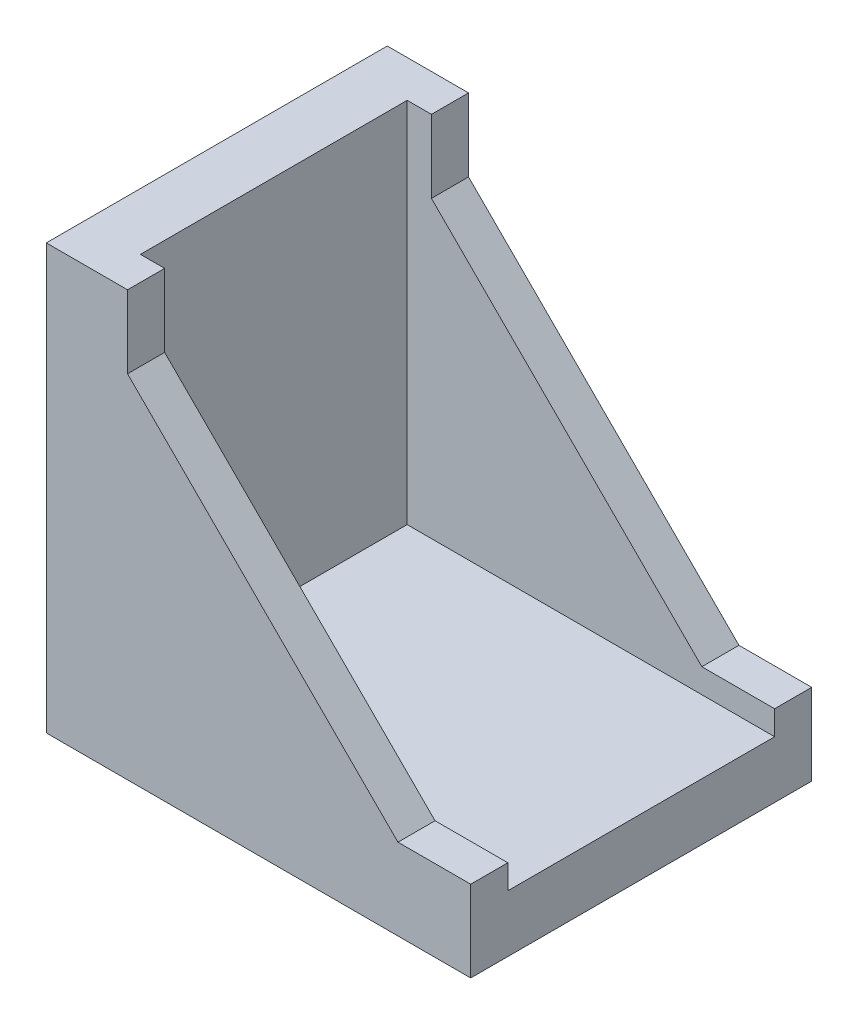
ISO-10303-21;
HEADER;
FILE_DESCRIPTION(('STEP AP214'),'2;1');
FILE_NAME('part.step','',(''),(''),'','','');
FILE_SCHEMA(('AUTOMOTIVE_DESIGN { 1 0 10303 214 1 1 1 1 }'));
ENDSEC;
DATA;
#1=APPLICATION_CONTEXT('core data for automotive mechanical design processes');
#2=APPLICATION_PROTOCOL_DEFINITION('international standard','automotive_design',2000,#1);
#3=PRODUCT_CONTEXT('',#1,'mechanical');
#4=PRODUCT('Part','Part','',(#3));
#5=PRODUCT_RELATED_PRODUCT_CATEGORY('part','',(#4));
#6=PRODUCT_DEFINITION_FORMATION('','',#4);
#7=PRODUCT_DEFINITION_CONTEXT('part definition',#1,'design');
#8=PRODUCT_DEFINITION('design','',#6,#7);
#9=PRODUCT_DEFINITION_SHAPE('','',#8);
#10=(LENGTH_UNIT() NAMED_UNIT(*) SI_UNIT(.MILLI.,.METRE.));
#11=(NAMED_UNIT(*) PLANE_ANGLE_UNIT() SI_UNIT($,.RADIAN.));
#12=(NAMED_UNIT(*) SI_UNIT($,.STERADIAN.) SOLID_ANGLE_UNIT());
#13=UNCERTAINTY_MEASURE_WITH_UNIT(LENGTH_MEASURE(1.E-05),#10,'distance_accuracy_value','');
#14=(GEOMETRIC_REPRESENTATION_CONTEXT(3) GLOBAL_UNCERTAINTY_ASSIGNED_CONTEXT((#13)) GLOBAL_UNIT_ASSIGNED_CONTEXT((#10,
#11,#12)) REPRESENTATION_CONTEXT('',''));
#15=CARTESIAN_POINT('',(0.,0.,0.));
#16=DIRECTION('',(0.,0.,1.));
#17=DIRECTION('',(1.,0.,0.));
#18=AXIS2_PLACEMENT_3D('',#15,#16,#17);
#19=CARTESIAN_POINT('',(29.,6.7,14.06));
#20=DIRECTION('',(0.,-1.,0.));
#21=DIRECTION('',(0.,0.,-1.));
#22=AXIS2_PLACEMENT_3D('',#19,#20,#21);
#23=PLANE('',#22);
#24=DIRECTION('',(1.,0.,0.));
#25=VECTOR('',#24,1.);
#26=CARTESIAN_POINT('',(29.,6.7,11.));
#27=LINE('',#26,#25);
#28=CARTESIAN_POINT('',(29.,6.7,11.));
#29=VERTEX_POINT('',#28);
#30=CARTESIAN_POINT('',(34.9999999999983,6.7,11.));
#31=VERTEX_POINT('',#30);
#32=EDGE_CURVE('E204',#29,#31,#27,.T.);
#33=ORIENTED_EDGE('',*,*,#32,.F.);
#34=DIRECTION('',(0.,0.,-1.));
#35=VECTOR('',#34,1.);
#36=CARTESIAN_POINT('',(29.,6.7,14.06));
#37=LINE('',#36,#35);
#38=CARTESIAN_POINT('',(29.,6.7,14.06));
#39=VERTEX_POINT('',#38);
#40=EDGE_CURVE('E165',#39,#29,#37,.T.);
#41=ORIENTED_EDGE('',*,*,#40,.F.);
#42=DIRECTION('',(-1.,0.,0.));
#43=VECTOR('',#42,1.);
#44=CARTESIAN_POINT('',(29.,6.7,14.06));
#45=LINE('',#44,#43);
#46=CARTESIAN_POINT('',(35.,6.7,14.06));
#47=VERTEX_POINT('',#46);
#48=EDGE_CURVE('E216',#47,#39,#45,.T.);
#49=ORIENTED_EDGE('',*,*,#48,.F.);
#50=DIRECTION('',(0.,0.,-1.));
#51=VECTOR('',#50,1.);
#52=CARTESIAN_POINT('',(35.,6.7,14.06));
#53=LINE('',#52,#51);
#54=EDGE_CURVE('E169',#47,#31,#53,.T.);
#55=ORIENTED_EDGE('',*,*,#54,.T.);
#56=EDGE_LOOP('',(#33,#41,#49,#55));
#57=FACE_BOUND('',#56,.T.);
#58=ADVANCED_FACE('F33',(#57),#23,.F.);
#59=CARTESIAN_POINT('',(6.7,29.,14.06));
#60=DIRECTION('',(-0.707106781186548,-0.707106781186548,0.));
#61=DIRECTION('',(0.707106781186548,-0.707106781186548,0.));
#62=AXIS2_PLACEMENT_3D('',#59,#60,#61);
#63=PLANE('',#62);
#64=DIRECTION('',(0.707106781186548,-0.707106781186548,0.));
#65=VECTOR('',#64,1.);
#66=CARTESIAN_POINT('',(6.7,29.,11.));
#67=LINE('',#66,#65);
#68=CARTESIAN_POINT('',(6.7,29.,11.));
#69=VERTEX_POINT('',#68);
#70=EDGE_CURVE('E191',#69,#29,#67,.T.);
#71=ORIENTED_EDGE('',*,*,#70,.F.);
#72=DIRECTION('',(0.,0.,-1.));
#73=VECTOR('',#72,1.);
#74=CARTESIAN_POINT('',(6.7,29.,14.06));
#75=LINE('',#74,#73);
#76=CARTESIAN_POINT('',(6.7,29.,14.06));
#77=VERTEX_POINT('',#76);
#78=EDGE_CURVE('E162',#77,#69,#75,.T.);
#79=ORIENTED_EDGE('',*,*,#78,.F.);
#80=DIRECTION('',(-0.707106781186547,0.707106781186547,0.));
#81=VECTOR('',#80,1.);
#82=CARTESIAN_POINT('',(6.7,29.,14.06));
#83=LINE('',#82,#81);
#84=EDGE_CURVE('E115',#39,#77,#83,.T.);
#85=ORIENTED_EDGE('',*,*,#84,.F.);
#86=ORIENTED_EDGE('',*,*,#40,.T.);
#87=EDGE_LOOP('',(#71,#79,#85,#86));
#88=FACE_BOUND('',#87,.T.);
#89=ADVANCED_FACE('F223',(#88),#63,.F.);
#90=CARTESIAN_POINT('',(6.7,35.,14.06));
#91=DIRECTION('',(-1.,0.,0.));
#92=DIRECTION('',(0.,0.,1.));
#93=AXIS2_PLACEMENT_3D('',#90,#91,#92);
#94=PLANE('',#93);
#95=DIRECTION('',(0.,-1.,0.));
#96=VECTOR('',#95,1.);
#97=CARTESIAN_POINT('',(6.7,35.,11.));
#98=LINE('',#97,#96);
#99=CARTESIAN_POINT('',(6.7,34.9999999999983,11.));
#100=VERTEX_POINT('',#99);
#101=EDGE_CURVE('E126',#100,#69,#98,.T.);
#102=ORIENTED_EDGE('',*,*,#101,.F.);
#103=DIRECTION('',(0.,0.,-1.));
#104=VECTOR('',#103,1.);
#105=CARTESIAN_POINT('',(6.7,35.,14.06));
#106=LINE('',#105,#104);
#107=CARTESIAN_POINT('',(6.7,35.,14.06));
#108=VERTEX_POINT('',#107);
#109=EDGE_CURVE('E122',#108,#100,#106,.T.);
#110=ORIENTED_EDGE('',*,*,#109,.F.);
#111=DIRECTION('',(0.,1.,0.));
#112=VECTOR('',#111,1.);
#113=CARTESIAN_POINT('',(6.7,35.,14.06));
#114=LINE('',#113,#112);
#115=EDGE_CURVE('E108',#77,#108,#114,.T.);
#116=ORIENTED_EDGE('',*,*,#115,.F.);
#117=ORIENTED_EDGE('',*,*,#78,.T.);
#118=EDGE_LOOP('',(#102,#110,#116,#117));
#119=FACE_BOUND('',#118,.T.);
#120=ADVANCED_FACE('F123',(#119),#94,.F.);
#121=CARTESIAN_POINT('',(35.,0.,14.06));
#122=DIRECTION('',(0.,1.,0.));
#123=DIRECTION('',(0.,0.,1.));
#124=AXIS2_PLACEMENT_3D('',#121,#122,#123);
#125=PLANE('',#124);
#126=DIRECTION('',(1.,0.,0.));
#127=VECTOR('',#126,1.);
#128=CARTESIAN_POINT('',(35.,0.,-14.06));
#129=LINE('',#128,#127);
#130=CARTESIAN_POINT('',(0.,0.,-14.06));
#131=VERTEX_POINT('',#130);
#132=CARTESIAN_POINT('',(35.,0.,-14.06));
#133=VERTEX_POINT('',#132);
#134=EDGE_CURVE('E140',#131,#133,#129,.T.);
#135=ORIENTED_EDGE('',*,*,#134,.T.);
#136=DIRECTION('',(0.,0.,-1.));
#137=VECTOR('',#136,1.);
#138=CARTESIAN_POINT('',(35.,0.,14.06));
#139=LINE('',#138,#137);
#140=CARTESIAN_POINT('',(35.,0.,14.06));
#141=VERTEX_POINT('',#140);
#142=EDGE_CURVE('E172',#141,#133,#139,.T.);
#143=ORIENTED_EDGE('',*,*,#142,.F.);
#144=DIRECTION('',(1.,0.,0.));
#145=VECTOR('',#144,1.);
#146=CARTESIAN_POINT('',(35.,0.,14.06));
#147=LINE('',#146,#145);
#148=CARTESIAN_POINT('',(0.,0.,14.06));
#149=VERTEX_POINT('',#148);
#150=EDGE_CURVE('E159',#149,#141,#147,.T.);
#151=ORIENTED_EDGE('',*,*,#150,.F.);
#152=DIRECTION('',(0.,0.,-1.));
#153=VECTOR('',#152,1.);
#154=CARTESIAN_POINT('',(0.,0.,14.06));
#155=LINE('',#154,#153);
#156=EDGE_CURVE('E136',#149,#131,#155,.T.);
#157=ORIENTED_EDGE('',*,*,#156,.T.);
#158=EDGE_LOOP('',(#135,#143,#151,#157));
#159=FACE_BOUND('',#158,.T.);
#160=ADVANCED_FACE('F35',(#159),#125,.F.);
#161=CARTESIAN_POINT('',(35.,6.7,14.06));
#162=DIRECTION('',(-1.,0.,0.));
#163=DIRECTION('',(0.,0.,1.));
#164=AXIS2_PLACEMENT_3D('',#161,#162,#163);
#165=PLANE('',#164);
#166=CARTESIAN_POINT('',(34.9999999999983,6.7,-11.));
#167=VERTEX_POINT('',#166);
#168=CARTESIAN_POINT('',(35.,6.7,-14.06));
#169=VERTEX_POINT('',#168);
#170=EDGE_CURVE('E168',#167,#169,#53,.T.);
#171=ORIENTED_EDGE('',*,*,#170,.F.);
#172=DIRECTION('',(0.,1.,0.));
#173=VECTOR('',#172,1.);
#174=CARTESIAN_POINT('',(34.9999999999983,4.69999999999274,-11.));
#175=LINE('',#174,#173);
#176=CARTESIAN_POINT('',(34.9999999999983,4.69999999999274,-11.));
#177=VERTEX_POINT('',#176);
#178=EDGE_CURVE('E201',#177,#167,#175,.T.);
#179=ORIENTED_EDGE('',*,*,#178,.F.);
#180=DIRECTION('',(0.,0.,1.));
#181=VECTOR('',#180,1.);
#182=CARTESIAN_POINT('',(34.9999999999983,4.69999999999274,-11.));
#183=LINE('',#182,#181);
#184=CARTESIAN_POINT('',(34.9999999999983,4.69999999999274,11.));
#185=VERTEX_POINT('',#184);
#186=EDGE_CURVE('E189',#177,#185,#183,.T.);
#187=ORIENTED_EDGE('',*,*,#186,.T.);
#188=DIRECTION('',(0.,1.,0.));
#189=VECTOR('',#188,1.);
#190=CARTESIAN_POINT('',(34.9999999999983,4.69999999999274,11.));
#191=LINE('',#190,#189);
#192=EDGE_CURVE('E197',#185,#31,#191,.T.);
#193=ORIENTED_EDGE('',*,*,#192,.T.);
#194=ORIENTED_EDGE('',*,*,#54,.F.);
#195=DIRECTION('',(0.,1.,0.));
#196=VECTOR('',#195,1.);
#197=CARTESIAN_POINT('',(35.,6.7,14.06));
#198=LINE('',#197,#196);
#199=EDGE_CURVE('E96',#141,#47,#198,.T.);
#200=ORIENTED_EDGE('',*,*,#199,.F.);
#201=ORIENTED_EDGE('',*,*,#142,.T.);
#202=DIRECTION('',(0.,1.,0.));
#203=VECTOR('',#202,1.);
#204=CARTESIAN_POINT('',(35.,6.7,-14.06));
#205=LINE('',#204,#203);
#206=EDGE_CURVE('E143',#133,#169,#205,.T.);
#207=ORIENTED_EDGE('',*,*,#206,.T.);
#208=EDGE_LOOP('',(#171,#179,#187,#193,#194,#200,#201,#207));
#209=FACE_BOUND('',#208,.T.);
#210=ADVANCED_FACE('F276',(#209),#165,.F.);
#211=CARTESIAN_POINT('',(29.,6.7,-11.));
#212=VERTEX_POINT('',#211);
#213=CARTESIAN_POINT('',(29.,6.7,-14.06));
#214=VERTEX_POINT('',#213);
#215=EDGE_CURVE('E164',#212,#214,#37,.T.);
#216=ORIENTED_EDGE('',*,*,#215,.F.);
#217=DIRECTION('',(1.,0.,0.));
#218=VECTOR('',#217,1.);
#219=CARTESIAN_POINT('',(29.,6.7,-11.));
#220=LINE('',#219,#218);
#221=EDGE_CURVE('E144',#212,#167,#220,.T.);
#222=ORIENTED_EDGE('',*,*,#221,.T.);
#223=ORIENTED_EDGE('',*,*,#170,.T.);
#224=DIRECTION('',(-1.,0.,0.));
#225=VECTOR('',#224,1.);
#226=CARTESIAN_POINT('',(29.,6.7,-14.06));
#227=LINE('',#226,#225);
#228=EDGE_CURVE('E147',#169,#214,#227,.T.);
#229=ORIENTED_EDGE('',*,*,#228,.T.);
#230=EDGE_LOOP('',(#216,#222,#223,#229));
#231=FACE_BOUND('',#230,.T.);
#232=ADVANCED_FACE('F245',(#231),#23,.F.);
#233=CARTESIAN_POINT('',(6.7,29.,-11.));
#234=VERTEX_POINT('',#233);
#235=CARTESIAN_POINT('',(6.7,29.,-14.06));
#236=VERTEX_POINT('',#235);
#237=EDGE_CURVE('E129',#234,#236,#75,.T.);
#238=ORIENTED_EDGE('',*,*,#237,.F.);
#239=DIRECTION('',(0.707106781186548,-0.707106781186548,0.));
#240=VECTOR('',#239,1.);
#241=CARTESIAN_POINT('',(6.7,29.,-11.));
#242=LINE('',#241,#240);
#243=EDGE_CURVE('E209',#234,#212,#242,.T.);
#244=ORIENTED_EDGE('',*,*,#243,.T.);
#245=ORIENTED_EDGE('',*,*,#215,.T.);
#246=DIRECTION('',(-0.707106781186547,0.707106781186547,0.));
#247=VECTOR('',#246,1.);
#248=CARTESIAN_POINT('',(6.7,29.,-14.06));
#249=LINE('',#248,#247);
#250=EDGE_CURVE('E150',#214,#236,#249,.T.);
#251=ORIENTED_EDGE('',*,*,#250,.T.);
#252=EDGE_LOOP('',(#238,#244,#245,#251));
#253=FACE_BOUND('',#252,.T.);
#254=ADVANCED_FACE('F244',(#253),#63,.F.);
#255=CARTESIAN_POINT('',(6.7,34.9999999999983,-11.));
#256=VERTEX_POINT('',#255);
#257=CARTESIAN_POINT('',(6.7,35.,-14.06));
#258=VERTEX_POINT('',#257);
#259=EDGE_CURVE('E130',#256,#258,#106,.T.);
#260=ORIENTED_EDGE('',*,*,#259,.F.);
#261=DIRECTION('',(0.,-1.,0.));
#262=VECTOR('',#261,1.);
#263=CARTESIAN_POINT('',(6.7,35.,-11.));
#264=LINE('',#263,#262);
#265=EDGE_CURVE('E206',#256,#234,#264,.T.);
#266=ORIENTED_EDGE('',*,*,#265,.T.);
#267=ORIENTED_EDGE('',*,*,#237,.T.);
#268=DIRECTION('',(0.,1.,0.));
#269=VECTOR('',#268,1.);
#270=CARTESIAN_POINT('',(6.7,35.,-14.06));
#271=LINE('',#270,#269);
#272=EDGE_CURVE('E153',#236,#258,#271,.T.);
#273=ORIENTED_EDGE('',*,*,#272,.T.);
#274=EDGE_LOOP('',(#260,#266,#267,#273));
#275=FACE_BOUND('',#274,.T.);
#276=ADVANCED_FACE('F254',(#275),#94,.F.);
#277=CARTESIAN_POINT('',(0.,35.,14.06));
#278=DIRECTION('',(0.,-1.,0.));
#279=DIRECTION('',(0.,0.,-1.));
#280=AXIS2_PLACEMENT_3D('',#277,#278,#279);
#281=PLANE('',#280);
#282=DIRECTION('',(0.,0.,1.));
#283=VECTOR('',#282,1.);
#284=CARTESIAN_POINT('',(4.70000000000696,34.9999999999983,-11.));
#285=LINE('',#284,#283);
#286=CARTESIAN_POINT('',(4.70000000000696,34.9999999999983,-11.));
#287=VERTEX_POINT('',#286);
#288=CARTESIAN_POINT('',(4.70000000000696,35.,11.));
#289=VERTEX_POINT('',#288);
#290=EDGE_CURVE('E181',#287,#289,#285,.T.);
#291=ORIENTED_EDGE('',*,*,#290,.F.);
#292=DIRECTION('',(1.,0.,0.));
#293=VECTOR('',#292,1.);
#294=CARTESIAN_POINT('',(0.,35.,-11.));
#295=LINE('',#294,#293);
#296=EDGE_CURVE('E11',#287,#256,#295,.T.);
#297=ORIENTED_EDGE('',*,*,#296,.T.);
#298=ORIENTED_EDGE('',*,*,#259,.T.);
#299=DIRECTION('',(-1.,0.,0.));
#300=VECTOR('',#299,1.);
#301=CARTESIAN_POINT('',(0.,35.,-14.06));
#302=LINE('',#301,#300);
#303=CARTESIAN_POINT('',(0.,35.,-14.06));
#304=VERTEX_POINT('',#303);
#305=EDGE_CURVE('E156',#258,#304,#302,.T.);
#306=ORIENTED_EDGE('',*,*,#305,.T.);
#307=DIRECTION('',(0.,0.,-1.));
#308=VECTOR('',#307,1.);
#309=CARTESIAN_POINT('',(0.,35.,14.06));
#310=LINE('',#309,#308);
#311=CARTESIAN_POINT('',(0.,35.,14.06));
#312=VERTEX_POINT('',#311);
#313=EDGE_CURVE('E134',#312,#304,#310,.T.);
#314=ORIENTED_EDGE('',*,*,#313,.F.);
#315=DIRECTION('',(-1.,0.,0.));
#316=VECTOR('',#315,1.);
#317=CARTESIAN_POINT('',(0.,35.,14.06));
#318=LINE('',#317,#316);
#319=EDGE_CURVE('E112',#108,#312,#318,.T.);
#320=ORIENTED_EDGE('',*,*,#319,.F.);
#321=ORIENTED_EDGE('',*,*,#109,.T.);
#322=DIRECTION('',(1.,0.,0.));
#323=VECTOR('',#322,1.);
#324=CARTESIAN_POINT('',(0.,35.,11.));
#325=LINE('',#324,#323);
#326=EDGE_CURVE('E41',#289,#100,#325,.T.);
#327=ORIENTED_EDGE('',*,*,#326,.F.);
#328=EDGE_LOOP('',(#291,#297,#298,#306,#314,#320,#321,#327));
#329=FACE_BOUND('',#328,.T.);
#330=ADVANCED_FACE('F133',(#329),#281,.F.);
#331=CARTESIAN_POINT('',(0.,0.,14.06));
#332=DIRECTION('',(1.,0.,0.));
#333=DIRECTION('',(0.,0.,-1.));
#334=AXIS2_PLACEMENT_3D('',#331,#332,#333);
#335=PLANE('',#334);
#336=DIRECTION('',(0.,-1.,0.));
#337=VECTOR('',#336,1.);
#338=CARTESIAN_POINT('',(0.,0.,-14.06));
#339=LINE('',#338,#337);
#340=EDGE_CURVE('E87',#304,#131,#339,.T.);
#341=ORIENTED_EDGE('',*,*,#340,.T.);
#342=ORIENTED_EDGE('',*,*,#156,.F.);
#343=DIRECTION('',(0.,-1.,0.));
#344=VECTOR('',#343,1.);
#345=CARTESIAN_POINT('',(0.,0.,14.06));
#346=LINE('',#345,#344);
#347=EDGE_CURVE('E57',#312,#149,#346,.T.);
#348=ORIENTED_EDGE('',*,*,#347,.F.);
#349=ORIENTED_EDGE('',*,*,#313,.T.);
#350=EDGE_LOOP('',(#341,#342,#348,#349));
#351=FACE_BOUND('',#350,.T.);
#352=ADVANCED_FACE('F283',(#351),#335,.F.);
#353=CARTESIAN_POINT('',(0.,0.,14.06));
#354=DIRECTION('',(0.,0.,-1.));
#355=DIRECTION('',(-1.,0.,0.));
#356=AXIS2_PLACEMENT_3D('',#353,#354,#355);
#357=PLANE('',#356);
#358=ORIENTED_EDGE('',*,*,#150,.T.);
#359=ORIENTED_EDGE('',*,*,#199,.T.);
#360=ORIENTED_EDGE('',*,*,#48,.T.);
#361=ORIENTED_EDGE('',*,*,#84,.T.);
#362=ORIENTED_EDGE('',*,*,#115,.T.);
#363=ORIENTED_EDGE('',*,*,#319,.T.);
#364=ORIENTED_EDGE('',*,*,#347,.T.);
#365=EDGE_LOOP('',(#358,#359,#360,#361,#362,#363,#364));
#366=FACE_BOUND('',#365,.T.);
#367=ADVANCED_FACE('F110',(#366),#357,.F.);
#368=CARTESIAN_POINT('',(0.,0.,-14.06));
#369=DIRECTION('',(0.,0.,-1.));
#370=DIRECTION('',(-1.,0.,0.));
#371=AXIS2_PLACEMENT_3D('',#368,#369,#370);
#372=PLANE('',#371);
#373=ORIENTED_EDGE('',*,*,#134,.F.);
#374=ORIENTED_EDGE('',*,*,#340,.F.);
#375=ORIENTED_EDGE('',*,*,#305,.F.);
#376=ORIENTED_EDGE('',*,*,#272,.F.);
#377=ORIENTED_EDGE('',*,*,#250,.F.);
#378=ORIENTED_EDGE('',*,*,#228,.F.);
#379=ORIENTED_EDGE('',*,*,#206,.F.);
#380=EDGE_LOOP('',(#373,#374,#375,#376,#377,#378,#379));
#381=FACE_BOUND('',#380,.T.);
#382=ADVANCED_FACE('F251',(#381),#372,.T.);
#383=CARTESIAN_POINT('',(0.,0.,-11.));
#384=DIRECTION('',(0.,0.,-1.));
#385=DIRECTION('',(-1.,0.,0.));
#386=AXIS2_PLACEMENT_3D('',#383,#384,#385);
#387=PLANE('',#386);
#388=ORIENTED_EDGE('',*,*,#243,.F.);
#389=ORIENTED_EDGE('',*,*,#265,.F.);
#390=ORIENTED_EDGE('',*,*,#296,.F.);
#391=DIRECTION('',(0.,-1.,0.));
#392=VECTOR('',#391,1.);
#393=CARTESIAN_POINT('',(4.70000000000696,4.69999999999274,-11.));
#394=LINE('',#393,#392);
#395=CARTESIAN_POINT('',(4.70000000000696,4.69999999999274,-11.));
#396=VERTEX_POINT('',#395);
#397=EDGE_CURVE('E257',#287,#396,#394,.T.);
#398=ORIENTED_EDGE('',*,*,#397,.T.);
#399=DIRECTION('',(1.,0.,0.));
#400=VECTOR('',#399,1.);
#401=CARTESIAN_POINT('',(4.70000000000696,4.69999999999274,-11.));
#402=LINE('',#401,#400);
#403=EDGE_CURVE('E261',#396,#177,#402,.T.);
#404=ORIENTED_EDGE('',*,*,#403,.T.);
#405=ORIENTED_EDGE('',*,*,#178,.T.);
#406=ORIENTED_EDGE('',*,*,#221,.F.);
#407=EDGE_LOOP('',(#388,#389,#390,#398,#404,#405,#406));
#408=FACE_BOUND('',#407,.T.);
#409=ADVANCED_FACE('F236',(#408),#387,.F.);
#410=CARTESIAN_POINT('',(0.,0.,11.));
#411=DIRECTION('',(0.,0.,-1.));
#412=DIRECTION('',(-1.,0.,0.));
#413=AXIS2_PLACEMENT_3D('',#410,#411,#412);
#414=PLANE('',#413);
#415=ORIENTED_EDGE('',*,*,#32,.T.);
#416=ORIENTED_EDGE('',*,*,#192,.F.);
#417=DIRECTION('',(1.,0.,0.));
#418=VECTOR('',#417,1.);
#419=CARTESIAN_POINT('',(4.70000000000696,4.69999999999274,11.));
#420=LINE('',#419,#418);
#421=CARTESIAN_POINT('',(4.70000000000696,4.69999999999274,11.));
#422=VERTEX_POINT('',#421);
#423=EDGE_CURVE('E265',#422,#185,#420,.T.);
#424=ORIENTED_EDGE('',*,*,#423,.F.);
#425=DIRECTION('',(0.,-1.,0.));
#426=VECTOR('',#425,1.);
#427=CARTESIAN_POINT('',(4.70000000000696,4.69999999999274,11.));
#428=LINE('',#427,#426);
#429=EDGE_CURVE('E48',#289,#422,#428,.T.);
#430=ORIENTED_EDGE('',*,*,#429,.F.);
#431=ORIENTED_EDGE('',*,*,#326,.T.);
#432=ORIENTED_EDGE('',*,*,#101,.T.);
#433=ORIENTED_EDGE('',*,*,#70,.T.);
#434=EDGE_LOOP('',(#415,#416,#424,#430,#431,#432,#433));
#435=FACE_BOUND('',#434,.T.);
#436=ADVANCED_FACE('F174',(#435),#414,.T.);
#437=CARTESIAN_POINT('',(4.70000000000696,4.69999999999274,-11.));
#438=DIRECTION('',(-1.,0.,0.));
#439=DIRECTION('',(0.,0.,1.));
#440=AXIS2_PLACEMENT_3D('',#437,#438,#439);
#441=PLANE('',#440);
#442=ORIENTED_EDGE('',*,*,#429,.T.);
#443=DIRECTION('',(0.,0.,1.));
#444=VECTOR('',#443,1.);
#445=CARTESIAN_POINT('',(4.70000000000696,4.69999999999274,-11.));
#446=LINE('',#445,#444);
#447=EDGE_CURVE('E194',#396,#422,#446,.T.);
#448=ORIENTED_EDGE('',*,*,#447,.F.);
#449=ORIENTED_EDGE('',*,*,#397,.F.);
#450=ORIENTED_EDGE('',*,*,#290,.T.);
#451=EDGE_LOOP('',(#442,#448,#449,#450));
#452=FACE_BOUND('',#451,.T.);
#453=ADVANCED_FACE('F259',(#452),#441,.F.);
#454=CARTESIAN_POINT('',(4.70000000000696,4.69999999999274,-11.));
#455=DIRECTION('',(0.,-1.,0.));
#456=DIRECTION('',(0.,0.,-1.));
#457=AXIS2_PLACEMENT_3D('',#454,#455,#456);
#458=PLANE('',#457);
#459=ORIENTED_EDGE('',*,*,#423,.T.);
#460=ORIENTED_EDGE('',*,*,#186,.F.);
#461=ORIENTED_EDGE('',*,*,#403,.F.);
#462=ORIENTED_EDGE('',*,*,#447,.T.);
#463=EDGE_LOOP('',(#459,#460,#461,#462));
#464=FACE_BOUND('',#463,.T.);
#465=ADVANCED_FACE('F272',(#464),#458,.F.);
#466=CLOSED_SHELL('',(#58,#89,#120,#160,#210,#232,#254,#276,#330,#352,#367,#382,#409,#436,#453,#465));
#467=MANIFOLD_SOLID_BREP('B2',#466);
#468=ADVANCED_BREP_SHAPE_REPRESENTATION('',(#18,#467),#14);
#469=SHAPE_DEFINITION_REPRESENTATION(#9,#468);
ENDSEC;
END-ISO-10303-21;
